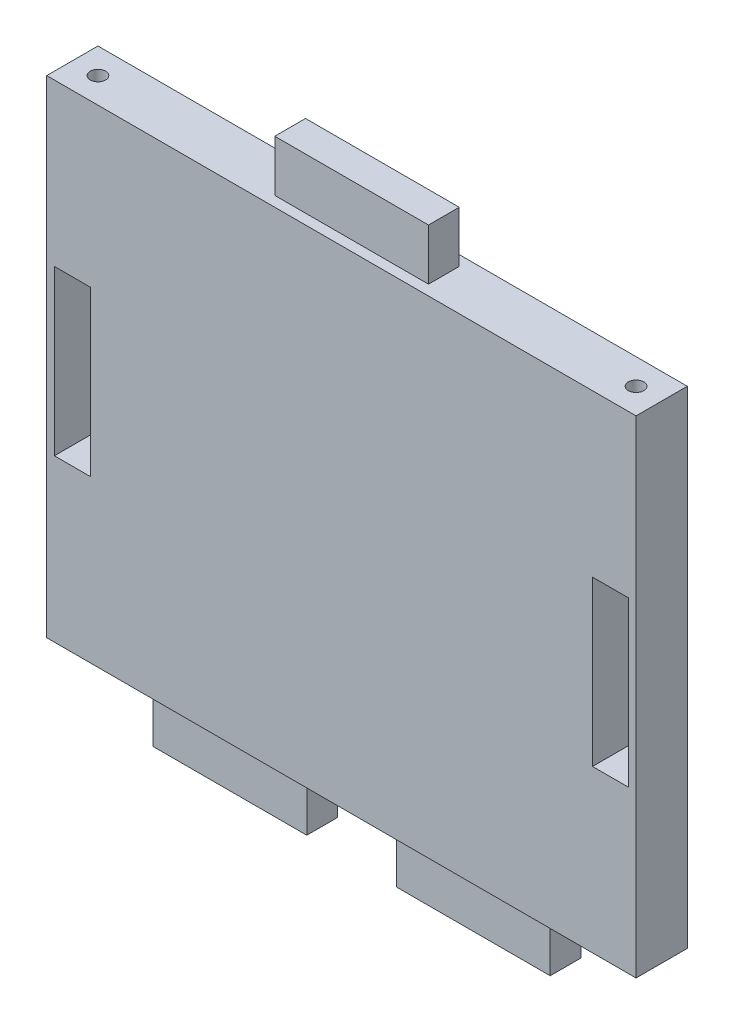
ISO-10303-21;
HEADER;
FILE_DESCRIPTION(('STEP AP214'),'2;1');
FILE_NAME('part.step','',(''),(''),'','','');
FILE_SCHEMA(('AUTOMOTIVE_DESIGN { 1 0 10303 214 1 1 1 1 }'));
ENDSEC;
DATA;
#1=APPLICATION_CONTEXT('core data for automotive mechanical design processes');
#2=APPLICATION_PROTOCOL_DEFINITION('international standard','automotive_design',2000,#1);
#3=PRODUCT_CONTEXT('',#1,'mechanical');
#4=PRODUCT('Part','Part','',(#3));
#5=PRODUCT_RELATED_PRODUCT_CATEGORY('part','',(#4));
#6=PRODUCT_DEFINITION_FORMATION('','',#4);
#7=PRODUCT_DEFINITION_CONTEXT('part definition',#1,'design');
#8=PRODUCT_DEFINITION('design','',#6,#7);
#9=PRODUCT_DEFINITION_SHAPE('','',#8);
#10=(LENGTH_UNIT() NAMED_UNIT(*) SI_UNIT(.MILLI.,.METRE.));
#11=(NAMED_UNIT(*) PLANE_ANGLE_UNIT() SI_UNIT($,.RADIAN.));
#12=(NAMED_UNIT(*) SI_UNIT($,.STERADIAN.) SOLID_ANGLE_UNIT());
#13=UNCERTAINTY_MEASURE_WITH_UNIT(LENGTH_MEASURE(1.E-05),#10,'distance_accuracy_value','');
#14=(GEOMETRIC_REPRESENTATION_CONTEXT(3) GLOBAL_UNCERTAINTY_ASSIGNED_CONTEXT((#13)) GLOBAL_UNIT_ASSIGNED_CONTEXT((#10,
#11,#12)) REPRESENTATION_CONTEXT('',''));
#15=CARTESIAN_POINT('',(0.,0.,0.));
#16=DIRECTION('',(0.,0.,1.));
#17=DIRECTION('',(1.,0.,0.));
#18=AXIS2_PLACEMENT_3D('',#15,#16,#17);
#19=CARTESIAN_POINT('',(57.5,-47.5,10.));
#20=DIRECTION('',(0.,1.,0.));
#21=DIRECTION('',(-1.,0.,0.));
#22=AXIS2_PLACEMENT_3D('',#19,#20,#21);
#23=PLANE('',#22);
#24=CARTESIAN_POINT('',(-52.5,-47.5,5.));
#25=DIRECTION('',(0.,-1.,0.));
#26=DIRECTION('',(1.,0.,0.));
#27=AXIS2_PLACEMENT_3D('',#24,#25,#26);
#28=CIRCLE('',#27,1.5);
#29=CARTESIAN_POINT('',(-51.,-47.5,5.));
#30=VERTEX_POINT('',#29);
#31=EDGE_CURVE('E791',#30,#30,#28,.T.);
#32=ORIENTED_EDGE('',*,*,#31,.F.);
#33=EDGE_LOOP('',(#32));
#34=FACE_BOUND('',#33,.T.);
#35=CARTESIAN_POINT('',(52.5,-47.5,5.));
#36=DIRECTION('',(0.,-1.,0.));
#37=DIRECTION('',(1.,0.,0.));
#38=AXIS2_PLACEMENT_3D('',#35,#36,#37);
#39=CIRCLE('',#38,1.5);
#40=CARTESIAN_POINT('',(54.,-47.5,5.));
#41=VERTEX_POINT('',#40);
#42=EDGE_CURVE('E800',#41,#41,#39,.T.);
#43=ORIENTED_EDGE('',*,*,#42,.F.);
#44=EDGE_LOOP('',(#43));
#45=FACE_BOUND('',#44,.T.);
#46=DIRECTION('',(0.,0.,-1.));
#47=VECTOR('',#46,1.);
#48=CARTESIAN_POINT('',(-38.75,-47.5,2.));
#49=LINE('',#48,#47);
#50=CARTESIAN_POINT('',(-38.75,-47.5,8.));
#51=VERTEX_POINT('',#50);
#52=CARTESIAN_POINT('',(-38.75,-47.5,2.));
#53=VERTEX_POINT('',#52);
#54=EDGE_CURVE('E299',#51,#53,#49,.T.);
#55=ORIENTED_EDGE('',*,*,#54,.F.);
#56=DIRECTION('',(-1.,0.,0.));
#57=VECTOR('',#56,1.);
#58=CARTESIAN_POINT('',(-8.75000000000001,-47.5,8.));
#59=LINE('',#58,#57);
#60=CARTESIAN_POINT('',(-8.75000000000001,-47.5,8.));
#61=VERTEX_POINT('',#60);
#62=EDGE_CURVE('E304',#61,#51,#59,.T.);
#63=ORIENTED_EDGE('',*,*,#62,.F.);
#64=DIRECTION('',(0.,0.,1.));
#65=VECTOR('',#64,1.);
#66=CARTESIAN_POINT('',(-8.75000000000001,-47.5,2.));
#67=LINE('',#66,#65);
#68=CARTESIAN_POINT('',(-8.75000000000001,-47.5,2.));
#69=VERTEX_POINT('',#68);
#70=EDGE_CURVE('E316',#69,#61,#67,.T.);
#71=ORIENTED_EDGE('',*,*,#70,.F.);
#72=DIRECTION('',(1.,0.,0.));
#73=VECTOR('',#72,1.);
#74=CARTESIAN_POINT('',(-8.75000000000001,-47.5,2.));
#75=LINE('',#74,#73);
#76=EDGE_CURVE('E313',#53,#69,#75,.T.);
#77=ORIENTED_EDGE('',*,*,#76,.F.);
#78=EDGE_LOOP('',(#55,#63,#71,#77));
#79=FACE_BOUND('',#78,.T.);
#80=DIRECTION('',(1.,0.,0.));
#81=VECTOR('',#80,1.);
#82=CARTESIAN_POINT('',(57.5,-47.5,0.));
#83=LINE('',#82,#81);
#84=CARTESIAN_POINT('',(-57.5,-47.5,0.));
#85=VERTEX_POINT('',#84);
#86=CARTESIAN_POINT('',(57.5,-47.5,0.));
#87=VERTEX_POINT('',#86);
#88=EDGE_CURVE('E379',#85,#87,#83,.T.);
#89=ORIENTED_EDGE('',*,*,#88,.T.);
#90=DIRECTION('',(0.,0.,-1.));
#91=VECTOR('',#90,1.);
#92=CARTESIAN_POINT('',(57.5,-47.5,10.));
#93=LINE('',#92,#91);
#94=CARTESIAN_POINT('',(57.5,-47.5,10.));
#95=VERTEX_POINT('',#94);
#96=EDGE_CURVE('E40',#95,#87,#93,.T.);
#97=ORIENTED_EDGE('',*,*,#96,.F.);
#98=DIRECTION('',(1.,0.,0.));
#99=VECTOR('',#98,1.);
#100=CARTESIAN_POINT('',(57.5,-47.5,10.));
#101=LINE('',#100,#99);
#102=CARTESIAN_POINT('',(-57.5,-47.5,10.));
#103=VERTEX_POINT('',#102);
#104=EDGE_CURVE('E369',#103,#95,#101,.T.);
#105=ORIENTED_EDGE('',*,*,#104,.F.);
#106=DIRECTION('',(0.,0.,-1.));
#107=VECTOR('',#106,1.);
#108=CARTESIAN_POINT('',(-57.5,-47.5,10.));
#109=LINE('',#108,#107);
#110=EDGE_CURVE('E11',#103,#85,#109,.T.);
#111=ORIENTED_EDGE('',*,*,#110,.T.);
#112=EDGE_LOOP('',(#89,#97,#105,#111));
#113=FACE_BOUND('',#112,.T.);
#114=DIRECTION('',(1.,0.,0.));
#115=VECTOR('',#114,1.);
#116=CARTESIAN_POINT('',(8.75,-47.5,2.));
#117=LINE('',#116,#115);
#118=CARTESIAN_POINT('',(8.75,-47.5,2.));
#119=VERTEX_POINT('',#118);
#120=CARTESIAN_POINT('',(38.75,-47.5,2.));
#121=VERTEX_POINT('',#120);
#122=EDGE_CURVE('E233',#119,#121,#117,.T.);
#123=ORIENTED_EDGE('',*,*,#122,.F.);
#124=DIRECTION('',(0.,0.,-1.));
#125=VECTOR('',#124,1.);
#126=CARTESIAN_POINT('',(8.75,-47.5,2.));
#127=LINE('',#126,#125);
#128=CARTESIAN_POINT('',(8.75000000000001,-47.5,8.));
#129=VERTEX_POINT('',#128);
#130=EDGE_CURVE('E271',#129,#119,#127,.T.);
#131=ORIENTED_EDGE('',*,*,#130,.F.);
#132=DIRECTION('',(-1.,0.,0.));
#133=VECTOR('',#132,1.);
#134=CARTESIAN_POINT('',(8.75,-47.5,8.));
#135=LINE('',#134,#133);
#136=CARTESIAN_POINT('',(38.75,-47.5,8.));
#137=VERTEX_POINT('',#136);
#138=EDGE_CURVE('E283',#137,#129,#135,.T.);
#139=ORIENTED_EDGE('',*,*,#138,.F.);
#140=DIRECTION('',(0.,0.,1.));
#141=VECTOR('',#140,1.);
#142=CARTESIAN_POINT('',(38.75,-47.5,2.));
#143=LINE('',#142,#141);
#144=EDGE_CURVE('E280',#121,#137,#143,.T.);
#145=ORIENTED_EDGE('',*,*,#144,.F.);
#146=EDGE_LOOP('',(#123,#131,#139,#145));
#147=FACE_BOUND('',#146,.T.);
#148=ADVANCED_FACE('F32',(#34,#45,#79,#113,#147),#23,.F.);
#149=CARTESIAN_POINT('',(57.5,47.5,10.));
#150=DIRECTION('',(0.,-1.,0.));
#151=DIRECTION('',(1.,0.,0.));
#152=AXIS2_PLACEMENT_3D('',#149,#150,#151);
#153=PLANE('',#152);
#154=CARTESIAN_POINT('',(52.5,47.5,5.));
#155=DIRECTION('',(0.,1.,0.));
#156=DIRECTION('',(-1.,0.,0.));
#157=AXIS2_PLACEMENT_3D('',#154,#155,#156);
#158=CIRCLE('',#157,1.5);
#159=CARTESIAN_POINT('',(51.,47.5,5.));
#160=VERTEX_POINT('',#159);
#161=EDGE_CURVE('E790',#160,#160,#158,.T.);
#162=ORIENTED_EDGE('',*,*,#161,.F.);
#163=EDGE_LOOP('',(#162));
#164=FACE_BOUND('',#163,.T.);
#165=CARTESIAN_POINT('',(-52.5,47.5,5.));
#166=DIRECTION('',(0.,1.,0.));
#167=DIRECTION('',(1.,0.,0.));
#168=AXIS2_PLACEMENT_3D('',#165,#166,#167);
#169=CIRCLE('',#168,1.5);
#170=CARTESIAN_POINT('',(-51.,47.5,5.));
#171=VERTEX_POINT('',#170);
#172=EDGE_CURVE('E220',#171,#171,#169,.T.);
#173=ORIENTED_EDGE('',*,*,#172,.F.);
#174=EDGE_LOOP('',(#173));
#175=FACE_BOUND('',#174,.T.);
#176=DIRECTION('',(-1.,0.,0.));
#177=VECTOR('',#176,1.);
#178=CARTESIAN_POINT('',(57.5,47.5,0.));
#179=LINE('',#178,#177);
#180=CARTESIAN_POINT('',(57.5,47.5,0.));
#181=VERTEX_POINT('',#180);
#182=CARTESIAN_POINT('',(-57.5,47.5,0.));
#183=VERTEX_POINT('',#182);
#184=EDGE_CURVE('E370',#181,#183,#179,.T.);
#185=ORIENTED_EDGE('',*,*,#184,.T.);
#186=DIRECTION('',(0.,0.,-1.));
#187=VECTOR('',#186,1.);
#188=CARTESIAN_POINT('',(-57.5,47.5,10.));
#189=LINE('',#188,#187);
#190=CARTESIAN_POINT('',(-57.5,47.5,10.));
#191=VERTEX_POINT('',#190);
#192=EDGE_CURVE('E376',#191,#183,#189,.T.);
#193=ORIENTED_EDGE('',*,*,#192,.F.);
#194=DIRECTION('',(-1.,0.,0.));
#195=VECTOR('',#194,1.);
#196=CARTESIAN_POINT('',(57.5,47.5,10.));
#197=LINE('',#196,#195);
#198=CARTESIAN_POINT('',(57.5,47.5,10.));
#199=VERTEX_POINT('',#198);
#200=EDGE_CURVE('E374',#199,#191,#197,.T.);
#201=ORIENTED_EDGE('',*,*,#200,.F.);
#202=DIRECTION('',(0.,0.,-1.));
#203=VECTOR('',#202,1.);
#204=CARTESIAN_POINT('',(57.5,47.5,10.));
#205=LINE('',#204,#203);
#206=EDGE_CURVE('E386',#199,#181,#205,.T.);
#207=ORIENTED_EDGE('',*,*,#206,.T.);
#208=EDGE_LOOP('',(#185,#193,#201,#207));
#209=FACE_BOUND('',#208,.T.);
#210=DIRECTION('',(0.,0.,1.));
#211=VECTOR('',#210,1.);
#212=CARTESIAN_POINT('',(-15.,47.5,8.00000000000001));
#213=LINE('',#212,#211);
#214=CARTESIAN_POINT('',(-15.,47.5,2.00000000000001));
#215=VERTEX_POINT('',#214);
#216=CARTESIAN_POINT('',(-15.,47.5,8.00000000000001));
#217=VERTEX_POINT('',#216);
#218=EDGE_CURVE('E332',#215,#217,#213,.T.);
#219=ORIENTED_EDGE('',*,*,#218,.F.);
#220=DIRECTION('',(-1.,0.,0.));
#221=VECTOR('',#220,1.);
#222=CARTESIAN_POINT('',(15.,47.5,2.00000000000001));
#223=LINE('',#222,#221);
#224=CARTESIAN_POINT('',(15.,47.5,2.00000000000001));
#225=VERTEX_POINT('',#224);
#226=EDGE_CURVE('E337',#225,#215,#223,.T.);
#227=ORIENTED_EDGE('',*,*,#226,.F.);
#228=DIRECTION('',(0.,0.,-1.));
#229=VECTOR('',#228,1.);
#230=CARTESIAN_POINT('',(15.,47.5,8.00000000000001));
#231=LINE('',#230,#229);
#232=CARTESIAN_POINT('',(15.,47.5,8.00000000000001));
#233=VERTEX_POINT('',#232);
#234=EDGE_CURVE('E349',#233,#225,#231,.T.);
#235=ORIENTED_EDGE('',*,*,#234,.F.);
#236=DIRECTION('',(1.,0.,0.));
#237=VECTOR('',#236,1.);
#238=CARTESIAN_POINT('',(15.,47.5,8.00000000000001));
#239=LINE('',#238,#237);
#240=EDGE_CURVE('E346',#217,#233,#239,.T.);
#241=ORIENTED_EDGE('',*,*,#240,.F.);
#242=EDGE_LOOP('',(#219,#227,#235,#241));
#243=FACE_BOUND('',#242,.T.);
#244=ADVANCED_FACE('F401',(#164,#175,#209,#243),#153,.F.);
#245=CARTESIAN_POINT('',(-57.5,-47.5,10.));
#246=DIRECTION('',(1.,0.,0.));
#247=DIRECTION('',(0.,0.,-1.));
#248=AXIS2_PLACEMENT_3D('',#245,#246,#247);
#249=PLANE('',#248);
#250=DIRECTION('',(0.,-1.,0.));
#251=VECTOR('',#250,1.);
#252=CARTESIAN_POINT('',(-57.5,-47.5,0.));
#253=LINE('',#252,#251);
#254=EDGE_CURVE('E365',#183,#85,#253,.T.);
#255=ORIENTED_EDGE('',*,*,#254,.T.);
#256=ORIENTED_EDGE('',*,*,#110,.F.);
#257=DIRECTION('',(0.,-1.,0.));
#258=VECTOR('',#257,1.);
#259=CARTESIAN_POINT('',(-57.5,-47.5,10.));
#260=LINE('',#259,#258);
#261=EDGE_CURVE('E366',#191,#103,#260,.T.);
#262=ORIENTED_EDGE('',*,*,#261,.F.);
#263=ORIENTED_EDGE('',*,*,#192,.T.);
#264=EDGE_LOOP('',(#255,#256,#262,#263));
#265=FACE_BOUND('',#264,.T.);
#266=ADVANCED_FACE('F34',(#265),#249,.F.);
#267=CARTESIAN_POINT('',(57.5,-47.5,10.));
#268=DIRECTION('',(-1.,0.,0.));
#269=DIRECTION('',(0.,-1.,0.));
#270=AXIS2_PLACEMENT_3D('',#267,#268,#269);
#271=PLANE('',#270);
#272=DIRECTION('',(0.,1.,0.));
#273=VECTOR('',#272,1.);
#274=CARTESIAN_POINT('',(57.5,-47.5,0.));
#275=LINE('',#274,#273);
#276=EDGE_CURVE('E381',#87,#181,#275,.T.);
#277=ORIENTED_EDGE('',*,*,#276,.T.);
#278=ORIENTED_EDGE('',*,*,#206,.F.);
#279=DIRECTION('',(0.,1.,0.));
#280=VECTOR('',#279,1.);
#281=CARTESIAN_POINT('',(57.5,-47.5,10.));
#282=LINE('',#281,#280);
#283=EDGE_CURVE('E372',#95,#199,#282,.T.);
#284=ORIENTED_EDGE('',*,*,#283,.F.);
#285=ORIENTED_EDGE('',*,*,#96,.T.);
#286=EDGE_LOOP('',(#277,#278,#284,#285));
#287=FACE_BOUND('',#286,.T.);
#288=ADVANCED_FACE('F393',(#287),#271,.F.);
#289=CARTESIAN_POINT('',(0.,0.,10.));
#290=DIRECTION('',(0.,0.,1.));
#291=DIRECTION('',(1.,0.,0.));
#292=AXIS2_PLACEMENT_3D('',#289,#290,#291);
#293=PLANE('',#292);
#294=DIRECTION('',(0.,-1.,0.));
#295=VECTOR('',#294,1.);
#296=CARTESIAN_POINT('',(-56.,-16.,10.));
#297=LINE('',#296,#295);
#298=CARTESIAN_POINT('',(-56.,16.,10.));
#299=VERTEX_POINT('',#298);
#300=CARTESIAN_POINT('',(-56.,-16.,10.));
#301=VERTEX_POINT('',#300);
#302=EDGE_CURVE('E47',#299,#301,#297,.T.);
#303=ORIENTED_EDGE('',*,*,#302,.F.);
#304=DIRECTION('',(-1.,0.,0.));
#305=VECTOR('',#304,1.);
#306=CARTESIAN_POINT('',(-49.,16.,10.));
#307=LINE('',#306,#305);
#308=CARTESIAN_POINT('',(-49.,16.,10.));
#309=VERTEX_POINT('',#308);
#310=EDGE_CURVE('E214',#309,#299,#307,.T.);
#311=ORIENTED_EDGE('',*,*,#310,.F.);
#312=DIRECTION('',(0.,1.,0.));
#313=VECTOR('',#312,1.);
#314=CARTESIAN_POINT('',(-49.,-16.,10.));
#315=LINE('',#314,#313);
#316=CARTESIAN_POINT('',(-49.,-16.,10.));
#317=VERTEX_POINT('',#316);
#318=EDGE_CURVE('E217',#317,#309,#315,.T.);
#319=ORIENTED_EDGE('',*,*,#318,.F.);
#320=DIRECTION('',(1.,0.,0.));
#321=VECTOR('',#320,1.);
#322=CARTESIAN_POINT('',(-49.,-16.,10.));
#323=LINE('',#322,#321);
#324=EDGE_CURVE('E226',#301,#317,#323,.T.);
#325=ORIENTED_EDGE('',*,*,#324,.F.);
#326=EDGE_LOOP('',(#303,#311,#319,#325));
#327=FACE_BOUND('',#326,.T.);
#328=DIRECTION('',(0.,-1.,0.));
#329=VECTOR('',#328,1.);
#330=CARTESIAN_POINT('',(49.,-16.,10.));
#331=LINE('',#330,#329);
#332=CARTESIAN_POINT('',(49.,16.,10.));
#333=VERTEX_POINT('',#332);
#334=CARTESIAN_POINT('',(49.,-16.,10.));
#335=VERTEX_POINT('',#334);
#336=EDGE_CURVE('E55',#333,#335,#331,.T.);
#337=ORIENTED_EDGE('',*,*,#336,.F.);
#338=DIRECTION('',(-1.,0.,0.));
#339=VECTOR('',#338,1.);
#340=CARTESIAN_POINT('',(49.,16.,10.));
#341=LINE('',#340,#339);
#342=CARTESIAN_POINT('',(56.,16.,10.));
#343=VERTEX_POINT('',#342);
#344=EDGE_CURVE('E241',#343,#333,#341,.T.);
#345=ORIENTED_EDGE('',*,*,#344,.F.);
#346=DIRECTION('',(0.,1.,0.));
#347=VECTOR('',#346,1.);
#348=CARTESIAN_POINT('',(56.,-16.,10.));
#349=LINE('',#348,#347);
#350=CARTESIAN_POINT('',(56.,-16.,10.));
#351=VERTEX_POINT('',#350);
#352=EDGE_CURVE('E256',#351,#343,#349,.T.);
#353=ORIENTED_EDGE('',*,*,#352,.F.);
#354=DIRECTION('',(1.,0.,0.));
#355=VECTOR('',#354,1.);
#356=CARTESIAN_POINT('',(49.,-16.,10.));
#357=LINE('',#356,#355);
#358=EDGE_CURVE('E252',#335,#351,#357,.T.);
#359=ORIENTED_EDGE('',*,*,#358,.F.);
#360=EDGE_LOOP('',(#337,#345,#353,#359));
#361=FACE_BOUND('',#360,.T.);
#362=ORIENTED_EDGE('',*,*,#261,.T.);
#363=ORIENTED_EDGE('',*,*,#104,.T.);
#364=ORIENTED_EDGE('',*,*,#283,.T.);
#365=ORIENTED_EDGE('',*,*,#200,.T.);
#366=EDGE_LOOP('',(#362,#363,#364,#365));
#367=FACE_BOUND('',#366,.T.);
#368=ADVANCED_FACE('F408',(#327,#361,#367),#293,.T.);
#369=CARTESIAN_POINT('',(0.,0.,0.));
#370=DIRECTION('',(0.,0.,1.));
#371=DIRECTION('',(1.,0.,0.));
#372=AXIS2_PLACEMENT_3D('',#369,#370,#371);
#373=PLANE('',#372);
#374=DIRECTION('',(-1.,0.,0.));
#375=VECTOR('',#374,1.);
#376=CARTESIAN_POINT('',(-49.,16.,0.));
#377=LINE('',#376,#375);
#378=CARTESIAN_POINT('',(-49.,16.,0.));
#379=VERTEX_POINT('',#378);
#380=CARTESIAN_POINT('',(-56.,16.,0.));
#381=VERTEX_POINT('',#380);
#382=EDGE_CURVE('E201',#379,#381,#377,.T.);
#383=ORIENTED_EDGE('',*,*,#382,.T.);
#384=DIRECTION('',(0.,-1.,0.));
#385=VECTOR('',#384,1.);
#386=CARTESIAN_POINT('',(-56.,-16.,0.));
#387=LINE('',#386,#385);
#388=CARTESIAN_POINT('',(-56.,-16.,0.));
#389=VERTEX_POINT('',#388);
#390=EDGE_CURVE('E195',#381,#389,#387,.T.);
#391=ORIENTED_EDGE('',*,*,#390,.T.);
#392=DIRECTION('',(1.,0.,0.));
#393=VECTOR('',#392,1.);
#394=CARTESIAN_POINT('',(-49.,-16.,0.));
#395=LINE('',#394,#393);
#396=CARTESIAN_POINT('',(-49.,-16.,0.));
#397=VERTEX_POINT('',#396);
#398=EDGE_CURVE('E205',#389,#397,#395,.T.);
#399=ORIENTED_EDGE('',*,*,#398,.T.);
#400=DIRECTION('',(0.,1.,0.));
#401=VECTOR('',#400,1.);
#402=CARTESIAN_POINT('',(-49.,-16.,0.));
#403=LINE('',#402,#401);
#404=EDGE_CURVE('E209',#397,#379,#403,.T.);
#405=ORIENTED_EDGE('',*,*,#404,.T.);
#406=EDGE_LOOP('',(#383,#391,#399,#405));
#407=FACE_BOUND('',#406,.T.);
#408=DIRECTION('',(-1.,0.,0.));
#409=VECTOR('',#408,1.);
#410=CARTESIAN_POINT('',(49.,16.,0.));
#411=LINE('',#410,#409);
#412=CARTESIAN_POINT('',(56.,16.,0.));
#413=VERTEX_POINT('',#412);
#414=CARTESIAN_POINT('',(49.,16.,0.));
#415=VERTEX_POINT('',#414);
#416=EDGE_CURVE('E247',#413,#415,#411,.T.);
#417=ORIENTED_EDGE('',*,*,#416,.T.);
#418=DIRECTION('',(0.,-1.,0.));
#419=VECTOR('',#418,1.);
#420=CARTESIAN_POINT('',(49.,-16.,0.));
#421=LINE('',#420,#419);
#422=CARTESIAN_POINT('',(49.,-16.,0.));
#423=VERTEX_POINT('',#422);
#424=EDGE_CURVE('E237',#415,#423,#421,.T.);
#425=ORIENTED_EDGE('',*,*,#424,.T.);
#426=DIRECTION('',(1.,0.,0.));
#427=VECTOR('',#426,1.);
#428=CARTESIAN_POINT('',(49.,-16.,0.));
#429=LINE('',#428,#427);
#430=CARTESIAN_POINT('',(56.,-16.,0.));
#431=VERTEX_POINT('',#430);
#432=EDGE_CURVE('E240',#423,#431,#429,.T.);
#433=ORIENTED_EDGE('',*,*,#432,.T.);
#434=DIRECTION('',(0.,1.,0.));
#435=VECTOR('',#434,1.);
#436=CARTESIAN_POINT('',(56.,-16.,0.));
#437=LINE('',#436,#435);
#438=EDGE_CURVE('E244',#431,#413,#437,.T.);
#439=ORIENTED_EDGE('',*,*,#438,.T.);
#440=EDGE_LOOP('',(#417,#425,#433,#439));
#441=FACE_BOUND('',#440,.T.);
#442=ORIENTED_EDGE('',*,*,#254,.F.);
#443=ORIENTED_EDGE('',*,*,#184,.F.);
#444=ORIENTED_EDGE('',*,*,#276,.F.);
#445=ORIENTED_EDGE('',*,*,#88,.F.);
#446=EDGE_LOOP('',(#442,#443,#444,#445));
#447=FACE_BOUND('',#446,.T.);
#448=ADVANCED_FACE('F211',(#407,#441,#447),#373,.F.);
#449=CARTESIAN_POINT('',(-15.,57.5,8.00000000000001));
#450=DIRECTION('',(1.,0.,0.));
#451=DIRECTION('',(0.,1.,0.));
#452=AXIS2_PLACEMENT_3D('',#449,#450,#451);
#453=PLANE('',#452);
#454=ORIENTED_EDGE('',*,*,#218,.T.);
#455=DIRECTION('',(0.,-1.,0.));
#456=VECTOR('',#455,1.);
#457=CARTESIAN_POINT('',(-15.,57.5,8.00000000000001));
#458=LINE('',#457,#456);
#459=CARTESIAN_POINT('',(-15.,57.5,8.00000000000001));
#460=VERTEX_POINT('',#459);
#461=EDGE_CURVE('E362',#460,#217,#458,.T.);
#462=ORIENTED_EDGE('',*,*,#461,.F.);
#463=DIRECTION('',(0.,0.,1.));
#464=VECTOR('',#463,1.);
#465=CARTESIAN_POINT('',(-15.,57.5,8.00000000000001));
#466=LINE('',#465,#464);
#467=CARTESIAN_POINT('',(-15.,57.5,2.00000000000001));
#468=VERTEX_POINT('',#467);
#469=EDGE_CURVE('E333',#468,#460,#466,.T.);
#470=ORIENTED_EDGE('',*,*,#469,.F.);
#471=DIRECTION('',(0.,-1.,0.));
#472=VECTOR('',#471,1.);
#473=CARTESIAN_POINT('',(-15.,57.5,2.00000000000001));
#474=LINE('',#473,#472);
#475=EDGE_CURVE('E343',#468,#215,#474,.T.);
#476=ORIENTED_EDGE('',*,*,#475,.T.);
#477=EDGE_LOOP('',(#454,#462,#470,#476));
#478=FACE_BOUND('',#477,.T.);
#479=ADVANCED_FACE('F474',(#478),#453,.F.);
#480=CARTESIAN_POINT('',(15.,57.5,8.00000000000001));
#481=DIRECTION('',(0.,0.,-1.));
#482=DIRECTION('',(-1.,0.,0.));
#483=AXIS2_PLACEMENT_3D('',#480,#481,#482);
#484=PLANE('',#483);
#485=ORIENTED_EDGE('',*,*,#240,.T.);
#486=DIRECTION('',(0.,-1.,0.));
#487=VECTOR('',#486,1.);
#488=CARTESIAN_POINT('',(15.,57.5,8.00000000000001));
#489=LINE('',#488,#487);
#490=CARTESIAN_POINT('',(15.,57.5,8.00000000000001));
#491=VERTEX_POINT('',#490);
#492=EDGE_CURVE('E359',#491,#233,#489,.T.);
#493=ORIENTED_EDGE('',*,*,#492,.F.);
#494=DIRECTION('',(1.,0.,0.));
#495=VECTOR('',#494,1.);
#496=CARTESIAN_POINT('',(15.,57.5,8.00000000000001));
#497=LINE('',#496,#495);
#498=EDGE_CURVE('E336',#460,#491,#497,.T.);
#499=ORIENTED_EDGE('',*,*,#498,.F.);
#500=ORIENTED_EDGE('',*,*,#461,.T.);
#501=EDGE_LOOP('',(#485,#493,#499,#500));
#502=FACE_BOUND('',#501,.T.);
#503=ADVANCED_FACE('F470',(#502),#484,.F.);
#504=CARTESIAN_POINT('',(15.,57.5,8.00000000000001));
#505=DIRECTION('',(-1.,0.,0.));
#506=DIRECTION('',(0.,-1.,0.));
#507=AXIS2_PLACEMENT_3D('',#504,#505,#506);
#508=PLANE('',#507);
#509=ORIENTED_EDGE('',*,*,#234,.T.);
#510=DIRECTION('',(0.,-1.,0.));
#511=VECTOR('',#510,1.);
#512=CARTESIAN_POINT('',(15.,57.5,2.00000000000001));
#513=LINE('',#512,#511);
#514=CARTESIAN_POINT('',(15.,57.5,2.00000000000001));
#515=VERTEX_POINT('',#514);
#516=EDGE_CURVE('E356',#515,#225,#513,.T.);
#517=ORIENTED_EDGE('',*,*,#516,.F.);
#518=DIRECTION('',(0.,0.,-1.));
#519=VECTOR('',#518,1.);
#520=CARTESIAN_POINT('',(15.,57.5,8.00000000000001));
#521=LINE('',#520,#519);
#522=EDGE_CURVE('E339',#491,#515,#521,.T.);
#523=ORIENTED_EDGE('',*,*,#522,.F.);
#524=ORIENTED_EDGE('',*,*,#492,.T.);
#525=EDGE_LOOP('',(#509,#517,#523,#524));
#526=FACE_BOUND('',#525,.T.);
#527=ADVANCED_FACE('F466',(#526),#508,.F.);
#528=CARTESIAN_POINT('',(15.,57.5,2.00000000000001));
#529=DIRECTION('',(0.,0.,1.));
#530=DIRECTION('',(1.,0.,0.));
#531=AXIS2_PLACEMENT_3D('',#528,#529,#530);
#532=PLANE('',#531);
#533=ORIENTED_EDGE('',*,*,#226,.T.);
#534=ORIENTED_EDGE('',*,*,#475,.F.);
#535=DIRECTION('',(-1.,0.,0.));
#536=VECTOR('',#535,1.);
#537=CARTESIAN_POINT('',(15.,57.5,2.00000000000001));
#538=LINE('',#537,#536);
#539=EDGE_CURVE('E341',#515,#468,#538,.T.);
#540=ORIENTED_EDGE('',*,*,#539,.F.);
#541=ORIENTED_EDGE('',*,*,#516,.T.);
#542=EDGE_LOOP('',(#533,#534,#540,#541));
#543=FACE_BOUND('',#542,.T.);
#544=ADVANCED_FACE('F462',(#543),#532,.F.);
#545=CARTESIAN_POINT('',(0.,57.5,0.));
#546=DIRECTION('',(0.,1.,0.));
#547=DIRECTION('',(0.,0.,1.));
#548=AXIS2_PLACEMENT_3D('',#545,#546,#547);
#549=PLANE('',#548);
#550=ORIENTED_EDGE('',*,*,#469,.T.);
#551=ORIENTED_EDGE('',*,*,#498,.T.);
#552=ORIENTED_EDGE('',*,*,#522,.T.);
#553=ORIENTED_EDGE('',*,*,#539,.T.);
#554=EDGE_LOOP('',(#550,#551,#552,#553));
#555=FACE_BOUND('',#554,.T.);
#556=ADVANCED_FACE('F458',(#555),#549,.T.);
#557=CARTESIAN_POINT('',(-38.75,-57.5,2.));
#558=DIRECTION('',(1.,0.,0.));
#559=DIRECTION('',(0.,1.,0.));
#560=AXIS2_PLACEMENT_3D('',#557,#558,#559);
#561=PLANE('',#560);
#562=ORIENTED_EDGE('',*,*,#54,.T.);
#563=DIRECTION('',(0.,1.,0.));
#564=VECTOR('',#563,1.);
#565=CARTESIAN_POINT('',(-38.75,-57.5,2.));
#566=LINE('',#565,#564);
#567=CARTESIAN_POINT('',(-38.75,-57.5,2.));
#568=VERTEX_POINT('',#567);
#569=EDGE_CURVE('E329',#568,#53,#566,.T.);
#570=ORIENTED_EDGE('',*,*,#569,.F.);
#571=DIRECTION('',(0.,0.,-1.));
#572=VECTOR('',#571,1.);
#573=CARTESIAN_POINT('',(-38.75,-57.5,2.));
#574=LINE('',#573,#572);
#575=CARTESIAN_POINT('',(-38.75,-57.5,8.));
#576=VERTEX_POINT('',#575);
#577=EDGE_CURVE('E300',#576,#568,#574,.T.);
#578=ORIENTED_EDGE('',*,*,#577,.F.);
#579=DIRECTION('',(0.,1.,0.));
#580=VECTOR('',#579,1.);
#581=CARTESIAN_POINT('',(-38.75,-57.5,8.));
#582=LINE('',#581,#580);
#583=EDGE_CURVE('E310',#576,#51,#582,.T.);
#584=ORIENTED_EDGE('',*,*,#583,.T.);
#585=EDGE_LOOP('',(#562,#570,#578,#584));
#586=FACE_BOUND('',#585,.T.);
#587=ADVANCED_FACE('F454',(#586),#561,.F.);
#588=CARTESIAN_POINT('',(-8.75000000000001,-57.5,2.));
#589=DIRECTION('',(0.,0.,1.));
#590=DIRECTION('',(1.,0.,0.));
#591=AXIS2_PLACEMENT_3D('',#588,#589,#590);
#592=PLANE('',#591);
#593=ORIENTED_EDGE('',*,*,#76,.T.);
#594=DIRECTION('',(0.,1.,0.));
#595=VECTOR('',#594,1.);
#596=CARTESIAN_POINT('',(-8.75000000000001,-57.5,2.));
#597=LINE('',#596,#595);
#598=CARTESIAN_POINT('',(-8.75000000000001,-57.5,2.));
#599=VERTEX_POINT('',#598);
#600=EDGE_CURVE('E326',#599,#69,#597,.T.);
#601=ORIENTED_EDGE('',*,*,#600,.F.);
#602=DIRECTION('',(1.,0.,0.));
#603=VECTOR('',#602,1.);
#604=CARTESIAN_POINT('',(-8.75000000000001,-57.5,2.));
#605=LINE('',#604,#603);
#606=EDGE_CURVE('E303',#568,#599,#605,.T.);
#607=ORIENTED_EDGE('',*,*,#606,.F.);
#608=ORIENTED_EDGE('',*,*,#569,.T.);
#609=EDGE_LOOP('',(#593,#601,#607,#608));
#610=FACE_BOUND('',#609,.T.);
#611=ADVANCED_FACE('F450',(#610),#592,.F.);
#612=CARTESIAN_POINT('',(-8.75000000000001,-57.5,2.));
#613=DIRECTION('',(-1.,0.,0.));
#614=DIRECTION('',(0.,-1.,0.));
#615=AXIS2_PLACEMENT_3D('',#612,#613,#614);
#616=PLANE('',#615);
#617=ORIENTED_EDGE('',*,*,#70,.T.);
#618=DIRECTION('',(0.,1.,0.));
#619=VECTOR('',#618,1.);
#620=CARTESIAN_POINT('',(-8.75000000000001,-57.5,8.));
#621=LINE('',#620,#619);
#622=CARTESIAN_POINT('',(-8.75000000000001,-57.5,8.));
#623=VERTEX_POINT('',#622);
#624=EDGE_CURVE('E323',#623,#61,#621,.T.);
#625=ORIENTED_EDGE('',*,*,#624,.F.);
#626=DIRECTION('',(0.,0.,1.));
#627=VECTOR('',#626,1.);
#628=CARTESIAN_POINT('',(-8.75000000000001,-57.5,2.));
#629=LINE('',#628,#627);
#630=EDGE_CURVE('E306',#599,#623,#629,.T.);
#631=ORIENTED_EDGE('',*,*,#630,.F.);
#632=ORIENTED_EDGE('',*,*,#600,.T.);
#633=EDGE_LOOP('',(#617,#625,#631,#632));
#634=FACE_BOUND('',#633,.T.);
#635=ADVANCED_FACE('F446',(#634),#616,.F.);
#636=CARTESIAN_POINT('',(-8.75000000000001,-57.5,8.));
#637=DIRECTION('',(0.,0.,-1.));
#638=DIRECTION('',(-1.,0.,0.));
#639=AXIS2_PLACEMENT_3D('',#636,#637,#638);
#640=PLANE('',#639);
#641=ORIENTED_EDGE('',*,*,#62,.T.);
#642=ORIENTED_EDGE('',*,*,#583,.F.);
#643=DIRECTION('',(-1.,0.,0.));
#644=VECTOR('',#643,1.);
#645=CARTESIAN_POINT('',(-8.75000000000001,-57.5,8.));
#646=LINE('',#645,#644);
#647=EDGE_CURVE('E308',#623,#576,#646,.T.);
#648=ORIENTED_EDGE('',*,*,#647,.F.);
#649=ORIENTED_EDGE('',*,*,#624,.T.);
#650=EDGE_LOOP('',(#641,#642,#648,#649));
#651=FACE_BOUND('',#650,.T.);
#652=ADVANCED_FACE('F442',(#651),#640,.F.);
#653=CARTESIAN_POINT('',(0.,-57.5,0.));
#654=DIRECTION('',(0.,-1.,0.));
#655=DIRECTION('',(0.,0.,-1.));
#656=AXIS2_PLACEMENT_3D('',#653,#654,#655);
#657=PLANE('',#656);
#658=ORIENTED_EDGE('',*,*,#577,.T.);
#659=ORIENTED_EDGE('',*,*,#606,.T.);
#660=ORIENTED_EDGE('',*,*,#630,.T.);
#661=ORIENTED_EDGE('',*,*,#647,.T.);
#662=EDGE_LOOP('',(#658,#659,#660,#661));
#663=FACE_BOUND('',#662,.T.);
#664=ADVANCED_FACE('F436',(#663),#657,.T.);
#665=CARTESIAN_POINT('',(8.75,-57.5,2.));
#666=DIRECTION('',(0.,0.,1.));
#667=DIRECTION('',(1.,0.,0.));
#668=AXIS2_PLACEMENT_3D('',#665,#666,#667);
#669=PLANE('',#668);
#670=ORIENTED_EDGE('',*,*,#122,.T.);
#671=DIRECTION('',(0.,1.,0.));
#672=VECTOR('',#671,1.);
#673=CARTESIAN_POINT('',(38.75,-57.5,2.));
#674=LINE('',#673,#672);
#675=CARTESIAN_POINT('',(38.75,-57.5,2.));
#676=VERTEX_POINT('',#675);
#677=EDGE_CURVE('E296',#676,#121,#674,.T.);
#678=ORIENTED_EDGE('',*,*,#677,.F.);
#679=DIRECTION('',(1.,0.,0.));
#680=VECTOR('',#679,1.);
#681=CARTESIAN_POINT('',(8.75,-57.5,2.));
#682=LINE('',#681,#680);
#683=CARTESIAN_POINT('',(8.75,-57.5,2.));
#684=VERTEX_POINT('',#683);
#685=EDGE_CURVE('E267',#684,#676,#682,.T.);
#686=ORIENTED_EDGE('',*,*,#685,.F.);
#687=DIRECTION('',(0.,1.,0.));
#688=VECTOR('',#687,1.);
#689=CARTESIAN_POINT('',(8.75,-57.5,2.));
#690=LINE('',#689,#688);
#691=EDGE_CURVE('E277',#684,#119,#690,.T.);
#692=ORIENTED_EDGE('',*,*,#691,.T.);
#693=EDGE_LOOP('',(#670,#678,#686,#692));
#694=FACE_BOUND('',#693,.T.);
#695=ADVANCED_FACE('F420',(#694),#669,.F.);
#696=CARTESIAN_POINT('',(38.75,-57.5,2.));
#697=DIRECTION('',(-1.,0.,0.));
#698=DIRECTION('',(0.,-1.,0.));
#699=AXIS2_PLACEMENT_3D('',#696,#697,#698);
#700=PLANE('',#699);
#701=ORIENTED_EDGE('',*,*,#144,.T.);
#702=DIRECTION('',(0.,1.,0.));
#703=VECTOR('',#702,1.);
#704=CARTESIAN_POINT('',(38.75,-57.5,8.));
#705=LINE('',#704,#703);
#706=CARTESIAN_POINT('',(38.75,-57.5,8.));
#707=VERTEX_POINT('',#706);
#708=EDGE_CURVE('E293',#707,#137,#705,.T.);
#709=ORIENTED_EDGE('',*,*,#708,.F.);
#710=DIRECTION('',(0.,0.,1.));
#711=VECTOR('',#710,1.);
#712=CARTESIAN_POINT('',(38.75,-57.5,2.));
#713=LINE('',#712,#711);
#714=EDGE_CURVE('E270',#676,#707,#713,.T.);
#715=ORIENTED_EDGE('',*,*,#714,.F.);
#716=ORIENTED_EDGE('',*,*,#677,.T.);
#717=EDGE_LOOP('',(#701,#709,#715,#716));
#718=FACE_BOUND('',#717,.T.);
#719=ADVANCED_FACE('F428',(#718),#700,.F.);
#720=CARTESIAN_POINT('',(8.75,-57.5,8.));
#721=DIRECTION('',(0.,0.,-1.));
#722=DIRECTION('',(-1.,0.,0.));
#723=AXIS2_PLACEMENT_3D('',#720,#721,#722);
#724=PLANE('',#723);
#725=ORIENTED_EDGE('',*,*,#138,.T.);
#726=DIRECTION('',(0.,1.,0.));
#727=VECTOR('',#726,1.);
#728=CARTESIAN_POINT('',(8.75,-57.5,8.));
#729=LINE('',#728,#727);
#730=CARTESIAN_POINT('',(8.75,-57.5,8.));
#731=VERTEX_POINT('',#730);
#732=EDGE_CURVE('E290',#731,#129,#729,.T.);
#733=ORIENTED_EDGE('',*,*,#732,.F.);
#734=DIRECTION('',(-1.,0.,0.));
#735=VECTOR('',#734,1.);
#736=CARTESIAN_POINT('',(8.75,-57.5,8.));
#737=LINE('',#736,#735);
#738=EDGE_CURVE('E273',#707,#731,#737,.T.);
#739=ORIENTED_EDGE('',*,*,#738,.F.);
#740=ORIENTED_EDGE('',*,*,#708,.T.);
#741=EDGE_LOOP('',(#725,#733,#739,#740));
#742=FACE_BOUND('',#741,.T.);
#743=ADVANCED_FACE('F426',(#742),#724,.F.);
#744=CARTESIAN_POINT('',(8.75,-57.5,2.));
#745=DIRECTION('',(1.,0.,0.));
#746=DIRECTION('',(0.,1.,0.));
#747=AXIS2_PLACEMENT_3D('',#744,#745,#746);
#748=PLANE('',#747);
#749=ORIENTED_EDGE('',*,*,#130,.T.);
#750=ORIENTED_EDGE('',*,*,#691,.F.);
#751=DIRECTION('',(0.,0.,-1.));
#752=VECTOR('',#751,1.);
#753=CARTESIAN_POINT('',(8.75,-57.5,2.));
#754=LINE('',#753,#752);
#755=EDGE_CURVE('E275',#731,#684,#754,.T.);
#756=ORIENTED_EDGE('',*,*,#755,.F.);
#757=ORIENTED_EDGE('',*,*,#732,.T.);
#758=EDGE_LOOP('',(#749,#750,#756,#757));
#759=FACE_BOUND('',#758,.T.);
#760=ADVANCED_FACE('F416',(#759),#748,.F.);
#761=CARTESIAN_POINT('',(0.,-57.5,0.));
#762=DIRECTION('',(0.,-1.,0.));
#763=DIRECTION('',(0.,0.,-1.));
#764=AXIS2_PLACEMENT_3D('',#761,#762,#763);
#765=PLANE('',#764);
#766=ORIENTED_EDGE('',*,*,#685,.T.);
#767=ORIENTED_EDGE('',*,*,#714,.T.);
#768=ORIENTED_EDGE('',*,*,#738,.T.);
#769=ORIENTED_EDGE('',*,*,#755,.T.);
#770=EDGE_LOOP('',(#766,#767,#768,#769));
#771=FACE_BOUND('',#770,.T.);
#772=ADVANCED_FACE('F422',(#771),#765,.T.);
#773=CARTESIAN_POINT('',(49.,-16.,0.));
#774=DIRECTION('',(-1.,0.,0.));
#775=DIRECTION('',(0.,0.,1.));
#776=AXIS2_PLACEMENT_3D('',#773,#774,#775);
#777=PLANE('',#776);
#778=ORIENTED_EDGE('',*,*,#336,.T.);
#779=DIRECTION('',(0.,0.,1.));
#780=VECTOR('',#779,1.);
#781=CARTESIAN_POINT('',(49.,-16.,0.));
#782=LINE('',#781,#780);
#783=EDGE_CURVE('E250',#423,#335,#782,.T.);
#784=ORIENTED_EDGE('',*,*,#783,.F.);
#785=ORIENTED_EDGE('',*,*,#424,.F.);
#786=DIRECTION('',(0.,0.,1.));
#787=VECTOR('',#786,1.);
#788=CARTESIAN_POINT('',(49.,16.,0.));
#789=LINE('',#788,#787);
#790=EDGE_CURVE('E227',#415,#333,#789,.T.);
#791=ORIENTED_EDGE('',*,*,#790,.T.);
#792=EDGE_LOOP('',(#778,#784,#785,#791));
#793=FACE_BOUND('',#792,.T.);
#794=ADVANCED_FACE('F588',(#793),#777,.F.);
#795=CARTESIAN_POINT('',(49.,16.,0.));
#796=DIRECTION('',(0.,1.,0.));
#797=DIRECTION('',(0.,0.,1.));
#798=AXIS2_PLACEMENT_3D('',#795,#796,#797);
#799=PLANE('',#798);
#800=ORIENTED_EDGE('',*,*,#344,.T.);
#801=ORIENTED_EDGE('',*,*,#790,.F.);
#802=ORIENTED_EDGE('',*,*,#416,.F.);
#803=DIRECTION('',(0.,0.,1.));
#804=VECTOR('',#803,1.);
#805=CARTESIAN_POINT('',(56.,16.,0.));
#806=LINE('',#805,#804);
#807=EDGE_CURVE('E262',#413,#343,#806,.T.);
#808=ORIENTED_EDGE('',*,*,#807,.T.);
#809=EDGE_LOOP('',(#800,#801,#802,#808));
#810=FACE_BOUND('',#809,.T.);
#811=ADVANCED_FACE('F584',(#810),#799,.F.);
#812=CARTESIAN_POINT('',(56.,-16.,0.));
#813=DIRECTION('',(1.,0.,0.));
#814=DIRECTION('',(0.,0.,-1.));
#815=AXIS2_PLACEMENT_3D('',#812,#813,#814);
#816=PLANE('',#815);
#817=ORIENTED_EDGE('',*,*,#352,.T.);
#818=ORIENTED_EDGE('',*,*,#807,.F.);
#819=ORIENTED_EDGE('',*,*,#438,.F.);
#820=DIRECTION('',(0.,0.,1.));
#821=VECTOR('',#820,1.);
#822=CARTESIAN_POINT('',(56.,-16.,0.));
#823=LINE('',#822,#821);
#824=EDGE_CURVE('E264',#431,#351,#823,.T.);
#825=ORIENTED_EDGE('',*,*,#824,.T.);
#826=EDGE_LOOP('',(#817,#818,#819,#825));
#827=FACE_BOUND('',#826,.T.);
#828=ADVANCED_FACE('F587',(#827),#816,.F.);
#829=CARTESIAN_POINT('',(49.,-16.,0.));
#830=DIRECTION('',(0.,-1.,0.));
#831=DIRECTION('',(1.,0.,0.));
#832=AXIS2_PLACEMENT_3D('',#829,#830,#831);
#833=PLANE('',#832);
#834=ORIENTED_EDGE('',*,*,#358,.T.);
#835=ORIENTED_EDGE('',*,*,#824,.F.);
#836=ORIENTED_EDGE('',*,*,#432,.F.);
#837=ORIENTED_EDGE('',*,*,#783,.T.);
#838=EDGE_LOOP('',(#834,#835,#836,#837));
#839=FACE_BOUND('',#838,.T.);
#840=ADVANCED_FACE('F583',(#839),#833,.F.);
#841=CARTESIAN_POINT('',(-56.,-16.,0.));
#842=DIRECTION('',(-1.,0.,0.));
#843=DIRECTION('',(0.,0.,1.));
#844=AXIS2_PLACEMENT_3D('',#841,#842,#843);
#845=PLANE('',#844);
#846=ORIENTED_EDGE('',*,*,#302,.T.);
#847=DIRECTION('',(0.,0.,1.));
#848=VECTOR('',#847,1.);
#849=CARTESIAN_POINT('',(-56.,-16.,0.));
#850=LINE('',#849,#848);
#851=EDGE_CURVE('E191',#389,#301,#850,.T.);
#852=ORIENTED_EDGE('',*,*,#851,.F.);
#853=ORIENTED_EDGE('',*,*,#390,.F.);
#854=DIRECTION('',(0.,0.,1.));
#855=VECTOR('',#854,1.);
#856=CARTESIAN_POINT('',(-56.,16.,0.));
#857=LINE('',#856,#855);
#858=EDGE_CURVE('E231',#381,#299,#857,.T.);
#859=ORIENTED_EDGE('',*,*,#858,.T.);
#860=EDGE_LOOP('',(#846,#852,#853,#859));
#861=FACE_BOUND('',#860,.T.);
#862=ADVANCED_FACE('F193',(#861),#845,.F.);
#863=CARTESIAN_POINT('',(-49.,16.,0.));
#864=DIRECTION('',(0.,1.,0.));
#865=DIRECTION('',(0.,0.,1.));
#866=AXIS2_PLACEMENT_3D('',#863,#864,#865);
#867=PLANE('',#866);
#868=ORIENTED_EDGE('',*,*,#310,.T.);
#869=ORIENTED_EDGE('',*,*,#858,.F.);
#870=ORIENTED_EDGE('',*,*,#382,.F.);
#871=DIRECTION('',(0.,0.,1.));
#872=VECTOR('',#871,1.);
#873=CARTESIAN_POINT('',(-49.,16.,0.));
#874=LINE('',#873,#872);
#875=EDGE_CURVE('E234',#379,#309,#874,.T.);
#876=ORIENTED_EDGE('',*,*,#875,.T.);
#877=EDGE_LOOP('',(#868,#869,#870,#876));
#878=FACE_BOUND('',#877,.T.);
#879=ADVANCED_FACE('F571',(#878),#867,.F.);
#880=CARTESIAN_POINT('',(-49.,-16.,0.));
#881=DIRECTION('',(1.,0.,0.));
#882=DIRECTION('',(0.,0.,-1.));
#883=AXIS2_PLACEMENT_3D('',#880,#881,#882);
#884=PLANE('',#883);
#885=ORIENTED_EDGE('',*,*,#318,.T.);
#886=ORIENTED_EDGE('',*,*,#875,.F.);
#887=ORIENTED_EDGE('',*,*,#404,.F.);
#888=DIRECTION('',(0.,0.,1.));
#889=VECTOR('',#888,1.);
#890=CARTESIAN_POINT('',(-49.,-16.,0.));
#891=LINE('',#890,#889);
#892=EDGE_CURVE('E200',#397,#317,#891,.T.);
#893=ORIENTED_EDGE('',*,*,#892,.T.);
#894=EDGE_LOOP('',(#885,#886,#887,#893));
#895=FACE_BOUND('',#894,.T.);
#896=ADVANCED_FACE('F574',(#895),#884,.F.);
#897=CARTESIAN_POINT('',(-49.,-16.,0.));
#898=DIRECTION('',(0.,-1.,0.));
#899=DIRECTION('',(1.,0.,0.));
#900=AXIS2_PLACEMENT_3D('',#897,#898,#899);
#901=PLANE('',#900);
#902=ORIENTED_EDGE('',*,*,#324,.T.);
#903=ORIENTED_EDGE('',*,*,#892,.F.);
#904=ORIENTED_EDGE('',*,*,#398,.F.);
#905=ORIENTED_EDGE('',*,*,#851,.T.);
#906=EDGE_LOOP('',(#902,#903,#904,#905));
#907=FACE_BOUND('',#906,.T.);
#908=ADVANCED_FACE('F206',(#907),#901,.F.);
#909=CARTESIAN_POINT('',(-52.5,39.5,5.));
#910=DIRECTION('',(0.,1.,0.));
#911=DIRECTION('',(-1.,0.,0.));
#912=AXIS2_PLACEMENT_3D('',#909,#910,#911);
#913=CYLINDRICAL_SURFACE('',#912,1.5);
#914=CARTESIAN_POINT('',(-52.5,39.5,5.));
#915=DIRECTION('',(0.,1.,0.));
#916=DIRECTION('',(1.,0.,0.));
#917=AXIS2_PLACEMENT_3D('',#914,#915,#916);
#918=CIRCLE('',#917,1.5);
#919=CARTESIAN_POINT('',(-51.,39.5,5.));
#920=VERTEX_POINT('',#919);
#921=EDGE_CURVE('E785',#920,#920,#918,.T.);
#922=ORIENTED_EDGE('',*,*,#921,.F.);
#923=EDGE_LOOP('',(#922));
#924=FACE_BOUND('',#923,.T.);
#925=ORIENTED_EDGE('',*,*,#172,.T.);
#926=EDGE_LOOP('',(#925));
#927=FACE_BOUND('',#926,.T.);
#928=ADVANCED_FACE('F566',(#924,#927),#913,.F.);
#929=CARTESIAN_POINT('',(-52.5,39.5,5.));
#930=DIRECTION('',(0.,-1.,0.));
#931=DIRECTION('',(1.,0.,0.));
#932=AXIS2_PLACEMENT_3D('',#929,#930,#931);
#933=PLANE('',#932);
#934=ORIENTED_EDGE('',*,*,#921,.T.);
#935=EDGE_LOOP('',(#934));
#936=FACE_BOUND('',#935,.T.);
#937=ADVANCED_FACE('F562',(#936),#933,.F.);
#938=CARTESIAN_POINT('',(52.5,39.5,5.));
#939=DIRECTION('',(0.,1.,0.));
#940=DIRECTION('',(-1.,0.,0.));
#941=AXIS2_PLACEMENT_3D('',#938,#939,#940);
#942=CYLINDRICAL_SURFACE('',#941,1.5);
#943=CARTESIAN_POINT('',(52.5,39.5,5.));
#944=DIRECTION('',(0.,1.,0.));
#945=DIRECTION('',(-1.,0.,0.));
#946=AXIS2_PLACEMENT_3D('',#943,#944,#945);
#947=CIRCLE('',#946,1.5);
#948=CARTESIAN_POINT('',(51.,39.5,5.));
#949=VERTEX_POINT('',#948);
#950=EDGE_CURVE('E253',#949,#949,#947,.T.);
#951=ORIENTED_EDGE('',*,*,#950,.F.);
#952=EDGE_LOOP('',(#951));
#953=FACE_BOUND('',#952,.T.);
#954=ORIENTED_EDGE('',*,*,#161,.T.);
#955=EDGE_LOOP('',(#954));
#956=FACE_BOUND('',#955,.T.);
#957=ADVANCED_FACE('F558',(#953,#956),#942,.F.);
#958=CARTESIAN_POINT('',(52.5,39.5,5.));
#959=DIRECTION('',(0.,1.,0.));
#960=DIRECTION('',(-1.,0.,0.));
#961=AXIS2_PLACEMENT_3D('',#958,#959,#960);
#962=PLANE('',#961);
#963=ORIENTED_EDGE('',*,*,#950,.T.);
#964=EDGE_LOOP('',(#963));
#965=FACE_BOUND('',#964,.T.);
#966=ADVANCED_FACE('F511',(#965),#962,.T.);
#967=CARTESIAN_POINT('',(52.5,-39.5,5.));
#968=DIRECTION('',(0.,-1.,0.));
#969=DIRECTION('',(1.,0.,0.));
#970=AXIS2_PLACEMENT_3D('',#967,#968,#969);
#971=CYLINDRICAL_SURFACE('',#970,1.5);
#972=CARTESIAN_POINT('',(52.5,-39.5,5.));
#973=DIRECTION('',(0.,-1.,0.));
#974=DIRECTION('',(1.,0.,0.));
#975=AXIS2_PLACEMENT_3D('',#972,#973,#974);
#976=CIRCLE('',#975,1.5);
#977=CARTESIAN_POINT('',(54.,-39.5,5.));
#978=VERTEX_POINT('',#977);
#979=EDGE_CURVE('E795',#978,#978,#976,.T.);
#980=ORIENTED_EDGE('',*,*,#979,.F.);
#981=EDGE_LOOP('',(#980));
#982=FACE_BOUND('',#981,.T.);
#983=ORIENTED_EDGE('',*,*,#42,.T.);
#984=EDGE_LOOP('',(#983));
#985=FACE_BOUND('',#984,.T.);
#986=ADVANCED_FACE('F516',(#982,#985),#971,.F.);
#987=CARTESIAN_POINT('',(52.5,-39.5,5.));
#988=DIRECTION('',(0.,-1.,0.));
#989=DIRECTION('',(1.,0.,0.));
#990=AXIS2_PLACEMENT_3D('',#987,#988,#989);
#991=PLANE('',#990);
#992=ORIENTED_EDGE('',*,*,#979,.T.);
#993=EDGE_LOOP('',(#992));
#994=FACE_BOUND('',#993,.T.);
#995=ADVANCED_FACE('F521',(#994),#991,.T.);
#996=CARTESIAN_POINT('',(-52.5,-39.5,5.));
#997=DIRECTION('',(0.,-1.,0.));
#998=DIRECTION('',(1.,0.,0.));
#999=AXIS2_PLACEMENT_3D('',#996,#997,#998);
#1000=CYLINDRICAL_SURFACE('',#999,1.5);
#1001=CARTESIAN_POINT('',(-52.5,-39.5,5.));
#1002=DIRECTION('',(0.,-1.,0.));
#1003=DIRECTION('',(1.,0.,0.));
#1004=AXIS2_PLACEMENT_3D('',#1001,#1002,#1003);
#1005=CIRCLE('',#1004,1.5);
#1006=CARTESIAN_POINT('',(-51.,-39.5,5.));
#1007=VERTEX_POINT('',#1006);
#1008=EDGE_CURVE('E789',#1007,#1007,#1005,.T.);
#1009=ORIENTED_EDGE('',*,*,#1008,.F.);
#1010=EDGE_LOOP('',(#1009));
#1011=FACE_BOUND('',#1010,.T.);
#1012=ORIENTED_EDGE('',*,*,#31,.T.);
#1013=EDGE_LOOP('',(#1012));
#1014=FACE_BOUND('',#1013,.T.);
#1015=ADVANCED_FACE('F531',(#1011,#1014),#1000,.F.);
#1016=CARTESIAN_POINT('',(-52.5,-39.5,5.));
#1017=DIRECTION('',(0.,-1.,0.));
#1018=DIRECTION('',(1.,0.,0.));
#1019=AXIS2_PLACEMENT_3D('',#1016,#1017,#1018);
#1020=PLANE('',#1019);
#1021=ORIENTED_EDGE('',*,*,#1008,.T.);
#1022=EDGE_LOOP('',(#1021));
#1023=FACE_BOUND('',#1022,.T.);
#1024=ADVANCED_FACE('F541',(#1023),#1020,.T.);
#1025=CLOSED_SHELL('',(#148,#244,#266,#288,#368,#448,#479,#503,#527,#544,#556,#587,#611,#635,
#652,#664,#695,#719,#743,#760,#772,#794,#811,#828,#840,#862,#879,#896,#908,#928,#937,#957,#966,
#986,#995,#1015,#1024));
#1026=MANIFOLD_SOLID_BREP('B2',#1025);
#1027=ADVANCED_BREP_SHAPE_REPRESENTATION('',(#18,#1026),#14);
#1028=SHAPE_DEFINITION_REPRESENTATION(#9,#1027);
ENDSEC;
END-ISO-10303-21;
